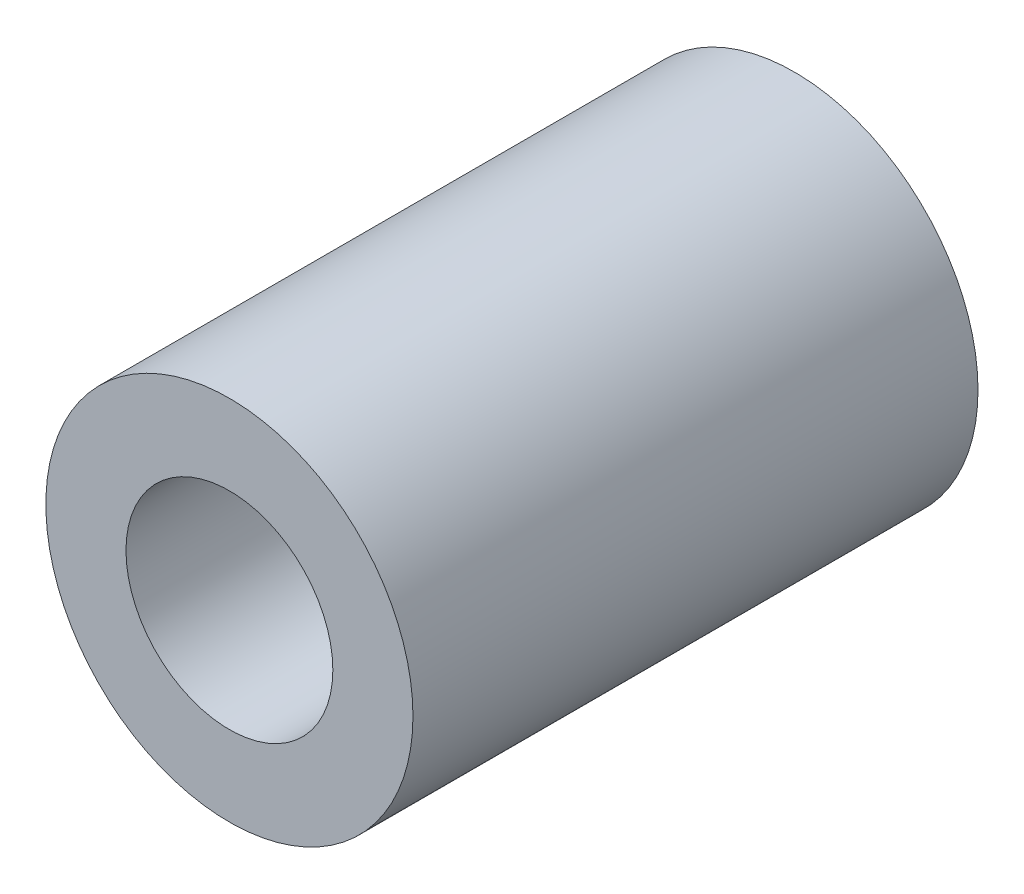
ISO-10303-21;
HEADER;
FILE_DESCRIPTION(('STEP AP214'),'2;1');
FILE_NAME('part.step','',(''),(''),'','','');
FILE_SCHEMA(('AUTOMOTIVE_DESIGN { 1 0 10303 214 1 1 1 1 }'));
ENDSEC;
DATA;
#1=APPLICATION_CONTEXT('core data for automotive mechanical design processes');
#2=APPLICATION_PROTOCOL_DEFINITION('international standard','automotive_design',2000,#1);
#3=PRODUCT_CONTEXT('',#1,'mechanical');
#4=PRODUCT('Part','Part','',(#3));
#5=PRODUCT_RELATED_PRODUCT_CATEGORY('part','',(#4));
#6=PRODUCT_DEFINITION_FORMATION('','',#4);
#7=PRODUCT_DEFINITION_CONTEXT('part definition',#1,'design');
#8=PRODUCT_DEFINITION('design','',#6,#7);
#9=PRODUCT_DEFINITION_SHAPE('','',#8);
#10=(LENGTH_UNIT() NAMED_UNIT(*) SI_UNIT(.MILLI.,.METRE.));
#11=(NAMED_UNIT(*) PLANE_ANGLE_UNIT() SI_UNIT($,.RADIAN.));
#12=(NAMED_UNIT(*) SI_UNIT($,.STERADIAN.) SOLID_ANGLE_UNIT());
#13=UNCERTAINTY_MEASURE_WITH_UNIT(LENGTH_MEASURE(1.E-05),#10,'distance_accuracy_value','');
#14=(GEOMETRIC_REPRESENTATION_CONTEXT(3) GLOBAL_UNCERTAINTY_ASSIGNED_CONTEXT((#13)) GLOBAL_UNIT_ASSIGNED_CONTEXT((#10,
#11,#12)) REPRESENTATION_CONTEXT('',''));
#15=CARTESIAN_POINT('',(0.,0.,0.));
#16=DIRECTION('',(0.,0.,1.));
#17=DIRECTION('',(1.,0.,0.));
#18=AXIS2_PLACEMENT_3D('',#15,#16,#17);
#19=CARTESIAN_POINT('',(0.,0.,18.3));
#20=DIRECTION('',(0.,0.,1.));
#21=DIRECTION('',(1.,0.,0.));
#22=AXIS2_PLACEMENT_3D('',#19,#20,#21);
#23=PLANE('',#22);
#24=CARTESIAN_POINT('',(0.,0.,18.3));
#25=DIRECTION('',(0.,0.,1.));
#26=DIRECTION('',(1.,0.,0.));
#27=AXIS2_PLACEMENT_3D('',#24,#25,#26);
#28=CIRCLE('',#27,5.945);
#29=CARTESIAN_POINT('',(5.945,0.,18.3));
#30=VERTEX_POINT('',#29);
#31=EDGE_CURVE('E10',#30,#30,#28,.T.);
#32=ORIENTED_EDGE('',*,*,#31,.T.);
#33=EDGE_LOOP('',(#32));
#34=FACE_BOUND('',#33,.T.);
#35=CARTESIAN_POINT('',(0.,0.,18.3));
#36=DIRECTION('',(0.,0.,1.));
#37=DIRECTION('',(1.,0.,0.));
#38=AXIS2_PLACEMENT_3D('',#35,#36,#37);
#39=CIRCLE('',#38,3.35);
#40=CARTESIAN_POINT('',(3.35,0.,18.3));
#41=VERTEX_POINT('',#40);
#42=EDGE_CURVE('E45',#41,#41,#39,.T.);
#43=ORIENTED_EDGE('',*,*,#42,.F.);
#44=EDGE_LOOP('',(#43));
#45=FACE_BOUND('',#44,.T.);
#46=ADVANCED_FACE('F34',(#34,#45),#23,.T.);
#47=CARTESIAN_POINT('',(0.,0.,0.));
#48=DIRECTION('',(0.,0.,1.));
#49=DIRECTION('',(1.,0.,0.));
#50=AXIS2_PLACEMENT_3D('',#47,#48,#49);
#51=PLANE('',#50);
#52=CARTESIAN_POINT('',(0.,0.,0.));
#53=DIRECTION('',(0.,0.,1.));
#54=DIRECTION('',(1.,0.,0.));
#55=AXIS2_PLACEMENT_3D('',#52,#53,#54);
#56=CIRCLE('',#55,5.945);
#57=CARTESIAN_POINT('',(5.945,0.,0.));
#58=VERTEX_POINT('',#57);
#59=EDGE_CURVE('E38',#58,#58,#56,.T.);
#60=ORIENTED_EDGE('',*,*,#59,.F.);
#61=EDGE_LOOP('',(#60));
#62=FACE_BOUND('',#61,.T.);
#63=CARTESIAN_POINT('',(0.,0.,0.));
#64=DIRECTION('',(0.,0.,1.));
#65=DIRECTION('',(1.,0.,0.));
#66=AXIS2_PLACEMENT_3D('',#63,#64,#65);
#67=CIRCLE('',#66,3.35);
#68=CARTESIAN_POINT('',(3.35,0.,0.));
#69=VERTEX_POINT('',#68);
#70=EDGE_CURVE('E47',#69,#69,#67,.T.);
#71=ORIENTED_EDGE('',*,*,#70,.T.);
#72=EDGE_LOOP('',(#71));
#73=FACE_BOUND('',#72,.T.);
#74=ADVANCED_FACE('F57',(#62,#73),#51,.F.);
#75=CARTESIAN_POINT('',(0.,0.,18.3));
#76=DIRECTION('',(0.,0.,-1.));
#77=DIRECTION('',(-1.,0.,0.));
#78=AXIS2_PLACEMENT_3D('',#75,#76,#77);
#79=CYLINDRICAL_SURFACE('',#78,5.945);
#80=ORIENTED_EDGE('',*,*,#31,.F.);
#81=EDGE_LOOP('',(#80));
#82=FACE_BOUND('',#81,.T.);
#83=ORIENTED_EDGE('',*,*,#59,.T.);
#84=EDGE_LOOP('',(#83));
#85=FACE_BOUND('',#84,.T.);
#86=ADVANCED_FACE('F36',(#82,#85),#79,.T.);
#87=CARTESIAN_POINT('',(0.,0.,18.3));
#88=DIRECTION('',(0.,0.,-1.));
#89=DIRECTION('',(-1.,0.,0.));
#90=AXIS2_PLACEMENT_3D('',#87,#88,#89);
#91=CYLINDRICAL_SURFACE('',#90,3.35);
#92=ORIENTED_EDGE('',*,*,#42,.T.);
#93=EDGE_LOOP('',(#92));
#94=FACE_BOUND('',#93,.T.);
#95=ORIENTED_EDGE('',*,*,#70,.F.);
#96=EDGE_LOOP('',(#95));
#97=FACE_BOUND('',#96,.T.);
#98=ADVANCED_FACE('F53',(#94,#97),#91,.F.);
#99=CLOSED_SHELL('',(#46,#74,#86,#98));
#100=MANIFOLD_SOLID_BREP('B2',#99);
#101=ADVANCED_BREP_SHAPE_REPRESENTATION('',(#18,#100),#14);
#102=SHAPE_DEFINITION_REPRESENTATION(#9,#101);
ENDSEC;
END-ISO-10303-21;
